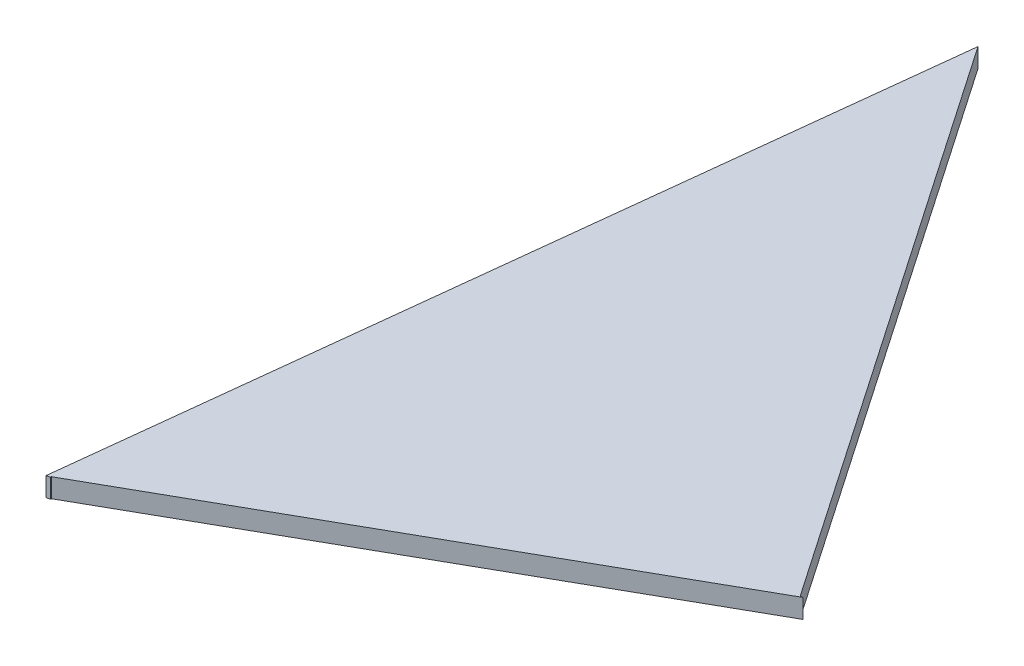
ISO-10303-21;
HEADER;
FILE_DESCRIPTION(('STEP AP214'),'2;1');
FILE_NAME('part.step','',(''),(''),'','','');
FILE_SCHEMA(('AUTOMOTIVE_DESIGN { 1 0 10303 214 1 1 1 1 }'));
ENDSEC;
DATA;
#1=APPLICATION_CONTEXT('core data for automotive mechanical design processes');
#2=APPLICATION_PROTOCOL_DEFINITION('international standard','automotive_design',2000,#1);
#3=PRODUCT_CONTEXT('',#1,'mechanical');
#4=PRODUCT('Part','Part','',(#3));
#5=PRODUCT_RELATED_PRODUCT_CATEGORY('part','',(#4));
#6=PRODUCT_DEFINITION_FORMATION('','',#4);
#7=PRODUCT_DEFINITION_CONTEXT('part definition',#1,'design');
#8=PRODUCT_DEFINITION('design','',#6,#7);
#9=PRODUCT_DEFINITION_SHAPE('','',#8);
#10=(LENGTH_UNIT() NAMED_UNIT(*) SI_UNIT(.MILLI.,.METRE.));
#11=(NAMED_UNIT(*) PLANE_ANGLE_UNIT() SI_UNIT($,.RADIAN.));
#12=(NAMED_UNIT(*) SI_UNIT($,.STERADIAN.) SOLID_ANGLE_UNIT());
#13=UNCERTAINTY_MEASURE_WITH_UNIT(LENGTH_MEASURE(1.E-05),#10,'distance_accuracy_value','');
#14=(GEOMETRIC_REPRESENTATION_CONTEXT(3) GLOBAL_UNCERTAINTY_ASSIGNED_CONTEXT((#13)) GLOBAL_UNIT_ASSIGNED_CONTEXT((#10,
#11,#12)) REPRESENTATION_CONTEXT('',''));
#15=CARTESIAN_POINT('',(0.,0.,0.));
#16=DIRECTION('',(0.,0.,1.));
#17=DIRECTION('',(1.,0.,0.));
#18=AXIS2_PLACEMENT_3D('',#15,#16,#17);
#19=CARTESIAN_POINT('',(0.377483633625664,2.,-0.178570482013307));
#20=DIRECTION('',(-0.491725486343513,0.,-0.870750277680252));
#21=DIRECTION('',(-0.870750277680252,0.,0.491725486343513));
#22=AXIS2_PLACEMENT_3D('',#19,#20,#21);
#23=PLANE('',#22);
#24=DIRECTION('',(0.870750277680252,0.,-0.491725486343513));
#25=VECTOR('',#24,1.);
#26=CARTESIAN_POINT('',(0.377483633625664,0.,-0.178570482013307));
#27=LINE('',#26,#25);
#28=CARTESIAN_POINT('',(0.377483633625664,0.,-0.178570482013307));
#29=VERTEX_POINT('',#28);
#30=CARTESIAN_POINT('',(50.6903544586706,0.,-28.590988496617));
#31=VERTEX_POINT('',#30);
#32=EDGE_CURVE('E128',#29,#31,#27,.T.);
#33=ORIENTED_EDGE('',*,*,#32,.T.);
#34=DIRECTION('',(0.,-1.,0.));
#35=VECTOR('',#34,1.);
#36=CARTESIAN_POINT('',(50.6903544586706,2.,-28.590988496617));
#37=LINE('',#36,#35);
#38=CARTESIAN_POINT('',(50.6903544586706,2.,-28.590988496617));
#39=VERTEX_POINT('',#38);
#40=EDGE_CURVE('E11',#39,#31,#37,.T.);
#41=ORIENTED_EDGE('',*,*,#40,.F.);
#42=DIRECTION('',(0.870750277680252,0.,-0.491725486343513));
#43=VECTOR('',#42,1.);
#44=CARTESIAN_POINT('',(0.377483633625664,2.,-0.178570482013307));
#45=LINE('',#44,#43);
#46=CARTESIAN_POINT('',(0.377483633625664,2.,-0.178570482013307));
#47=VERTEX_POINT('',#46);
#48=EDGE_CURVE('E144',#47,#39,#45,.T.);
#49=ORIENTED_EDGE('',*,*,#48,.F.);
#50=DIRECTION('',(0.,-1.,0.));
#51=VECTOR('',#50,1.);
#52=CARTESIAN_POINT('',(0.377483633625664,2.,-0.178570482013307));
#53=LINE('',#52,#51);
#54=EDGE_CURVE('E124',#47,#29,#53,.T.);
#55=ORIENTED_EDGE('',*,*,#54,.T.);
#56=EDGE_LOOP('',(#33,#41,#49,#55));
#57=FACE_BOUND('',#56,.T.);
#58=ADVANCED_FACE('F39',(#57),#23,.F.);
#59=CARTESIAN_POINT('',(50.6903544586706,2.,-28.590988496617));
#60=DIRECTION('',(0.109723499121695,0.,0.993962149048188));
#61=DIRECTION('',(0.993962149048188,0.,-0.109723499121695));
#62=AXIS2_PLACEMENT_3D('',#59,#60,#61);
#63=PLANE('',#62);
#64=DIRECTION('',(-0.993962149048188,0.,0.109723499121695));
#65=VECTOR('',#64,1.);
#66=CARTESIAN_POINT('',(50.6903544586706,0.,-28.590988496617));
#67=LINE('',#66,#65);
#68=CARTESIAN_POINT('',(50.4342960732421,0.,-28.5627222069443));
#69=VERTEX_POINT('',#68);
#70=EDGE_CURVE('E132',#31,#69,#67,.T.);
#71=ORIENTED_EDGE('',*,*,#70,.T.);
#72=DIRECTION('',(0.,-1.,0.));
#73=VECTOR('',#72,1.);
#74=CARTESIAN_POINT('',(50.4342960732421,2.,-28.5627222069443));
#75=LINE('',#74,#73);
#76=CARTESIAN_POINT('',(50.4342960732421,2.,-28.5627222069443));
#77=VERTEX_POINT('',#76);
#78=EDGE_CURVE('E48',#77,#69,#75,.T.);
#79=ORIENTED_EDGE('',*,*,#78,.F.);
#80=DIRECTION('',(-0.993962149048188,0.,0.109723499121695));
#81=VECTOR('',#80,1.);
#82=CARTESIAN_POINT('',(50.6903544586706,2.,-28.590988496617));
#83=LINE('',#82,#81);
#84=EDGE_CURVE('E93',#39,#77,#83,.T.);
#85=ORIENTED_EDGE('',*,*,#84,.F.);
#86=ORIENTED_EDGE('',*,*,#40,.T.);
#87=EDGE_LOOP('',(#71,#79,#85,#86));
#88=FACE_BOUND('',#87,.T.);
#89=ADVANCED_FACE('F172',(#88),#63,.F.);
#90=CARTESIAN_POINT('',(50.4342960732421,2.,-28.5627222069443));
#91=DIRECTION('',(-0.824930527304834,0.,0.565234133010886));
#92=DIRECTION('',(0.565234133010886,0.,0.824930527304834));
#93=AXIS2_PLACEMENT_3D('',#90,#91,#92);
#94=PLANE('',#93);
#95=DIRECTION('',(-0.565234133010886,0.,-0.824930527304834));
#96=VECTOR('',#95,1.);
#97=CARTESIAN_POINT('',(50.4342960732421,0.,-28.5627222069443));
#98=LINE('',#97,#96);
#99=CARTESIAN_POINT('',(9.89415958985065,0.,-87.7289936918442));
#100=VERTEX_POINT('',#99);
#101=EDGE_CURVE('E135',#69,#100,#98,.T.);
#102=ORIENTED_EDGE('',*,*,#101,.T.);
#103=DIRECTION('',(0.,-1.,0.));
#104=VECTOR('',#103,1.);
#105=CARTESIAN_POINT('',(9.89415958985065,2.,-87.7289936918442));
#106=LINE('',#105,#104);
#107=CARTESIAN_POINT('',(9.89415958985065,2.,-87.7289936918442));
#108=VERTEX_POINT('',#107);
#109=EDGE_CURVE('E117',#108,#100,#106,.T.);
#110=ORIENTED_EDGE('',*,*,#109,.F.);
#111=DIRECTION('',(-0.565234133010886,0.,-0.824930527304834));
#112=VECTOR('',#111,1.);
#113=CARTESIAN_POINT('',(50.4342960732421,2.,-28.5627222069443));
#114=LINE('',#113,#112);
#115=EDGE_CURVE('E106',#77,#108,#114,.T.);
#116=ORIENTED_EDGE('',*,*,#115,.F.);
#117=ORIENTED_EDGE('',*,*,#78,.T.);
#118=EDGE_LOOP('',(#102,#110,#116,#117));
#119=FACE_BOUND('',#118,.T.);
#120=ADVANCED_FACE('F154',(#119),#94,.F.);
#121=CARTESIAN_POINT('',(9.89415958985065,2.,-87.7289936918442));
#122=DIRECTION('',(0.993700262265481,0.,0.11207046343044));
#123=DIRECTION('',(0.11207046343044,0.,-0.993700262265481));
#124=AXIS2_PLACEMENT_3D('',#121,#122,#123);
#125=PLANE('',#124);
#126=DIRECTION('',(-0.11207046343044,0.,0.993700262265481));
#127=VECTOR('',#126,1.);
#128=CARTESIAN_POINT('',(9.89415958985065,0.,-87.7289936918442));
#129=LINE('',#128,#127);
#130=CARTESIAN_POINT('',(0.,0.,0.));
#131=VERTEX_POINT('',#130);
#132=EDGE_CURVE('E115',#100,#131,#129,.T.);
#133=ORIENTED_EDGE('',*,*,#132,.T.);
#134=DIRECTION('',(0.,-1.,0.));
#135=VECTOR('',#134,1.);
#136=CARTESIAN_POINT('',(0.,2.,0.));
#137=LINE('',#136,#135);
#138=CARTESIAN_POINT('',(0.,2.,0.));
#139=VERTEX_POINT('',#138);
#140=EDGE_CURVE('E112',#139,#131,#137,.T.);
#141=ORIENTED_EDGE('',*,*,#140,.F.);
#142=DIRECTION('',(-0.11207046343044,0.,0.993700262265481));
#143=VECTOR('',#142,1.);
#144=CARTESIAN_POINT('',(9.89415958985065,2.,-87.7289936918442));
#145=LINE('',#144,#143);
#146=EDGE_CURVE('E100',#108,#139,#145,.T.);
#147=ORIENTED_EDGE('',*,*,#146,.F.);
#148=ORIENTED_EDGE('',*,*,#109,.T.);
#149=EDGE_LOOP('',(#133,#141,#147,#148));
#150=FACE_BOUND('',#149,.T.);
#151=ADVANCED_FACE('F113',(#150),#125,.F.);
#152=CARTESIAN_POINT('',(0.,2.,0.));
#153=DIRECTION('',(-0.22063319838792,0.,-0.975356853551108));
#154=DIRECTION('',(-0.975356853551108,0.,0.22063319838792));
#155=AXIS2_PLACEMENT_3D('',#152,#153,#154);
#156=PLANE('',#155);
#157=DIRECTION('',(0.975356853551108,0.,-0.22063319838792));
#158=VECTOR('',#157,1.);
#159=CARTESIAN_POINT('',(0.,0.,0.));
#160=LINE('',#159,#158);
#161=CARTESIAN_POINT('',(0.377483633625664,0.,-0.085389692113913));
#162=VERTEX_POINT('',#161);
#163=EDGE_CURVE('E79',#131,#162,#160,.T.);
#164=ORIENTED_EDGE('',*,*,#163,.T.);
#165=DIRECTION('',(0.,-1.,0.));
#166=VECTOR('',#165,1.);
#167=CARTESIAN_POINT('',(0.377483633625664,2.,-0.085389692113913));
#168=LINE('',#167,#166);
#169=CARTESIAN_POINT('',(0.377483633625664,2.,-0.085389692113913));
#170=VERTEX_POINT('',#169);
#171=EDGE_CURVE('E118',#170,#162,#168,.T.);
#172=ORIENTED_EDGE('',*,*,#171,.F.);
#173=DIRECTION('',(0.975356853551108,0.,-0.22063319838792));
#174=VECTOR('',#173,1.);
#175=CARTESIAN_POINT('',(0.,2.,0.));
#176=LINE('',#175,#174);
#177=EDGE_CURVE('E104',#139,#170,#176,.T.);
#178=ORIENTED_EDGE('',*,*,#177,.F.);
#179=ORIENTED_EDGE('',*,*,#140,.T.);
#180=EDGE_LOOP('',(#164,#172,#178,#179));
#181=FACE_BOUND('',#180,.T.);
#182=ADVANCED_FACE('F120',(#181),#156,.F.);
#183=CARTESIAN_POINT('',(0.377483633625664,2.,-0.085389692113913));
#184=DIRECTION('',(-1.,0.,0.));
#185=DIRECTION('',(0.,0.,1.));
#186=AXIS2_PLACEMENT_3D('',#183,#184,#185);
#187=PLANE('',#186);
#188=DIRECTION('',(0.,0.,-1.));
#189=VECTOR('',#188,1.);
#190=CARTESIAN_POINT('',(0.377483633625664,0.,-0.085389692113913));
#191=LINE('',#190,#189);
#192=EDGE_CURVE('E85',#162,#29,#191,.T.);
#193=ORIENTED_EDGE('',*,*,#192,.T.);
#194=ORIENTED_EDGE('',*,*,#54,.F.);
#195=DIRECTION('',(0.,0.,-1.));
#196=VECTOR('',#195,1.);
#197=CARTESIAN_POINT('',(0.377483633625664,2.,-0.085389692113913));
#198=LINE('',#197,#196);
#199=EDGE_CURVE('E56',#170,#47,#198,.T.);
#200=ORIENTED_EDGE('',*,*,#199,.F.);
#201=ORIENTED_EDGE('',*,*,#171,.T.);
#202=EDGE_LOOP('',(#193,#194,#200,#201));
#203=FACE_BOUND('',#202,.T.);
#204=ADVANCED_FACE('F161',(#203),#187,.F.);
#205=CARTESIAN_POINT('',(0.,2.,0.));
#206=DIRECTION('',(0.,1.,0.));
#207=DIRECTION('',(0.,0.,1.));
#208=AXIS2_PLACEMENT_3D('',#205,#206,#207);
#209=PLANE('',#208);
#210=ORIENTED_EDGE('',*,*,#48,.T.);
#211=ORIENTED_EDGE('',*,*,#84,.T.);
#212=ORIENTED_EDGE('',*,*,#115,.T.);
#213=ORIENTED_EDGE('',*,*,#146,.T.);
#214=ORIENTED_EDGE('',*,*,#177,.T.);
#215=ORIENTED_EDGE('',*,*,#199,.T.);
#216=EDGE_LOOP('',(#210,#211,#212,#213,#214,#215));
#217=FACE_BOUND('',#216,.T.);
#218=ADVANCED_FACE('F102',(#217),#209,.T.);
#219=CARTESIAN_POINT('',(0.,0.,0.));
#220=DIRECTION('',(0.,1.,0.));
#221=DIRECTION('',(0.,0.,1.));
#222=AXIS2_PLACEMENT_3D('',#219,#220,#221);
#223=PLANE('',#222);
#224=ORIENTED_EDGE('',*,*,#32,.F.);
#225=ORIENTED_EDGE('',*,*,#192,.F.);
#226=ORIENTED_EDGE('',*,*,#163,.F.);
#227=ORIENTED_EDGE('',*,*,#132,.F.);
#228=ORIENTED_EDGE('',*,*,#101,.F.);
#229=ORIENTED_EDGE('',*,*,#70,.F.);
#230=EDGE_LOOP('',(#224,#225,#226,#227,#228,#229));
#231=FACE_BOUND('',#230,.T.);
#232=ADVANCED_FACE('F157',(#231),#223,.F.);
#233=CLOSED_SHELL('',(#58,#89,#120,#151,#182,#204,#218,#232));
#234=MANIFOLD_SOLID_BREP('B2',#233);
#235=ADVANCED_BREP_SHAPE_REPRESENTATION('',(#18,#234),#14);
#236=SHAPE_DEFINITION_REPRESENTATION(#9,#235);
ENDSEC;
END-ISO-10303-21;
